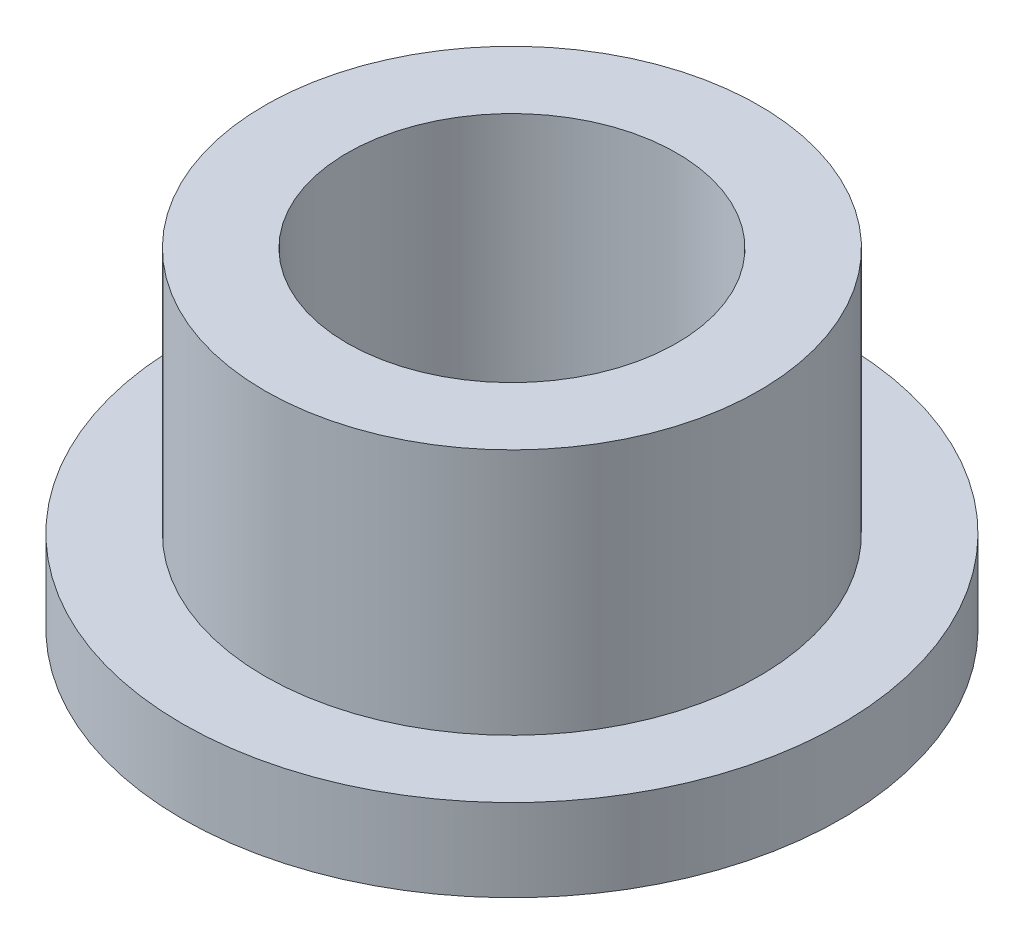
ISO-10303-21;
HEADER;
FILE_DESCRIPTION(('STEP AP214'),'2;1');
FILE_NAME('part.step','',(''),(''),'','','');
FILE_SCHEMA(('AUTOMOTIVE_DESIGN { 1 0 10303 214 1 1 1 1 }'));
ENDSEC;
DATA;
#1=APPLICATION_CONTEXT('core data for automotive mechanical design processes');
#2=APPLICATION_PROTOCOL_DEFINITION('international standard','automotive_design',2000,#1);
#3=PRODUCT_CONTEXT('',#1,'mechanical');
#4=PRODUCT('Part','Part','',(#3));
#5=PRODUCT_RELATED_PRODUCT_CATEGORY('part','',(#4));
#6=PRODUCT_DEFINITION_FORMATION('','',#4);
#7=PRODUCT_DEFINITION_CONTEXT('part definition',#1,'design');
#8=PRODUCT_DEFINITION('design','',#6,#7);
#9=PRODUCT_DEFINITION_SHAPE('','',#8);
#10=(LENGTH_UNIT() NAMED_UNIT(*) SI_UNIT(.MILLI.,.METRE.));
#11=(NAMED_UNIT(*) PLANE_ANGLE_UNIT() SI_UNIT($,.RADIAN.));
#12=(NAMED_UNIT(*) SI_UNIT($,.STERADIAN.) SOLID_ANGLE_UNIT());
#13=UNCERTAINTY_MEASURE_WITH_UNIT(LENGTH_MEASURE(1.E-05),#10,'distance_accuracy_value','');
#14=(GEOMETRIC_REPRESENTATION_CONTEXT(3) GLOBAL_UNCERTAINTY_ASSIGNED_CONTEXT((#13)) GLOBAL_UNIT_ASSIGNED_CONTEXT((#10,
#11,#12)) REPRESENTATION_CONTEXT('',''));
#15=CARTESIAN_POINT('',(0.,0.,0.));
#16=DIRECTION('',(0.,0.,1.));
#17=DIRECTION('',(1.,0.,0.));
#18=AXIS2_PLACEMENT_3D('',#15,#16,#17);
#19=CARTESIAN_POINT('',(0.,6.35,0.));
#20=DIRECTION('',(0.,1.,0.));
#21=DIRECTION('',(0.,0.,1.));
#22=AXIS2_PLACEMENT_3D('',#19,#20,#21);
#23=PLANE('',#22);
#24=CARTESIAN_POINT('',(0.,6.35,0.));
#25=DIRECTION('',(0.,1.,0.));
#26=DIRECTION('',(0.,0.,1.));
#27=AXIS2_PLACEMENT_3D('',#24,#25,#26);
#28=CIRCLE('',#27,4.7625);
#29=CARTESIAN_POINT('',(0.,6.35,4.7625));
#30=VERTEX_POINT('',#29);
#31=EDGE_CURVE('E10',#30,#30,#28,.T.);
#32=ORIENTED_EDGE('',*,*,#31,.T.);
#33=EDGE_LOOP('',(#32));
#34=FACE_BOUND('',#33,.T.);
#35=CARTESIAN_POINT('',(0.,6.35,0.));
#36=DIRECTION('',(0.,1.,0.));
#37=DIRECTION('',(0.,0.,1.));
#38=AXIS2_PLACEMENT_3D('',#35,#36,#37);
#39=CIRCLE('',#38,3.175);
#40=CARTESIAN_POINT('',(0.,6.35,3.175));
#41=VERTEX_POINT('',#40);
#42=EDGE_CURVE('E39',#41,#41,#39,.T.);
#43=ORIENTED_EDGE('',*,*,#42,.F.);
#44=EDGE_LOOP('',(#43));
#45=FACE_BOUND('',#44,.T.);
#46=ADVANCED_FACE('F32',(#34,#45),#23,.T.);
#47=CARTESIAN_POINT('',(0.,0.,0.));
#48=DIRECTION('',(0.,1.,0.));
#49=DIRECTION('',(0.,0.,1.));
#50=AXIS2_PLACEMENT_3D('',#47,#48,#49);
#51=PLANE('',#50);
#52=CARTESIAN_POINT('',(0.,0.,0.));
#53=DIRECTION('',(0.,1.,0.));
#54=DIRECTION('',(0.,0.,1.));
#55=AXIS2_PLACEMENT_3D('',#52,#53,#54);
#56=CIRCLE('',#55,3.175);
#57=CARTESIAN_POINT('',(0.,0.,3.175));
#58=VERTEX_POINT('',#57);
#59=EDGE_CURVE('E43',#58,#58,#56,.T.);
#60=ORIENTED_EDGE('',*,*,#59,.T.);
#61=EDGE_LOOP('',(#60));
#62=FACE_BOUND('',#61,.T.);
#63=CARTESIAN_POINT('',(0.,0.,0.));
#64=DIRECTION('',(0.,1.,0.));
#65=DIRECTION('',(0.,0.,1.));
#66=AXIS2_PLACEMENT_3D('',#63,#64,#65);
#67=CIRCLE('',#66,6.35);
#68=CARTESIAN_POINT('',(0.,0.,6.35));
#69=VERTEX_POINT('',#68);
#70=EDGE_CURVE('E50',#69,#69,#67,.T.);
#71=ORIENTED_EDGE('',*,*,#70,.F.);
#72=EDGE_LOOP('',(#71));
#73=FACE_BOUND('',#72,.T.);
#74=ADVANCED_FACE('F75',(#62,#73),#51,.F.);
#75=CARTESIAN_POINT('',(0.,6.35,0.));
#76=DIRECTION('',(0.,-1.,0.));
#77=DIRECTION('',(0.,0.,-1.));
#78=AXIS2_PLACEMENT_3D('',#75,#76,#77);
#79=CYLINDRICAL_SURFACE('',#78,4.7625);
#80=CARTESIAN_POINT('',(0.,1.5875,0.));
#81=DIRECTION('',(0.,1.,0.));
#82=DIRECTION('',(0.,0.,1.));
#83=AXIS2_PLACEMENT_3D('',#80,#81,#82);
#84=CIRCLE('',#83,4.7625);
#85=CARTESIAN_POINT('',(0.,1.5875,4.7625));
#86=VERTEX_POINT('',#85);
#87=EDGE_CURVE('E53',#86,#86,#84,.T.);
#88=ORIENTED_EDGE('',*,*,#87,.T.);
#89=EDGE_LOOP('',(#88));
#90=FACE_BOUND('',#89,.T.);
#91=ORIENTED_EDGE('',*,*,#31,.F.);
#92=EDGE_LOOP('',(#91));
#93=FACE_BOUND('',#92,.T.);
#94=ADVANCED_FACE('F34',(#90,#93),#79,.T.);
#95=CARTESIAN_POINT('',(0.,6.35,0.));
#96=DIRECTION('',(0.,-1.,0.));
#97=DIRECTION('',(0.,0.,-1.));
#98=AXIS2_PLACEMENT_3D('',#95,#96,#97);
#99=CYLINDRICAL_SURFACE('',#98,3.175);
#100=ORIENTED_EDGE('',*,*,#42,.T.);
#101=EDGE_LOOP('',(#100));
#102=FACE_BOUND('',#101,.T.);
#103=ORIENTED_EDGE('',*,*,#59,.F.);
#104=EDGE_LOOP('',(#103));
#105=FACE_BOUND('',#104,.T.);
#106=ADVANCED_FACE('F64',(#102,#105),#99,.F.);
#107=CARTESIAN_POINT('',(0.,1.5875,0.));
#108=DIRECTION('',(0.,1.,0.));
#109=DIRECTION('',(0.,0.,1.));
#110=AXIS2_PLACEMENT_3D('',#107,#108,#109);
#111=PLANE('',#110);
#112=CARTESIAN_POINT('',(0.,1.5875,0.));
#113=DIRECTION('',(0.,1.,0.));
#114=DIRECTION('',(0.,0.,1.));
#115=AXIS2_PLACEMENT_3D('',#112,#113,#114);
#116=CIRCLE('',#115,6.35);
#117=CARTESIAN_POINT('',(0.,1.5875,6.35));
#118=VERTEX_POINT('',#117);
#119=EDGE_CURVE('E48',#118,#118,#116,.T.);
#120=ORIENTED_EDGE('',*,*,#119,.T.);
#121=EDGE_LOOP('',(#120));
#122=FACE_BOUND('',#121,.T.);
#123=ORIENTED_EDGE('',*,*,#87,.F.);
#124=EDGE_LOOP('',(#123));
#125=FACE_BOUND('',#124,.T.);
#126=ADVANCED_FACE('F61',(#122,#125),#111,.T.);
#127=CARTESIAN_POINT('',(0.,1.5875,0.));
#128=DIRECTION('',(0.,-1.,0.));
#129=DIRECTION('',(0.,0.,-1.));
#130=AXIS2_PLACEMENT_3D('',#127,#128,#129);
#131=CYLINDRICAL_SURFACE('',#130,6.35);
#132=ORIENTED_EDGE('',*,*,#119,.F.);
#133=EDGE_LOOP('',(#132));
#134=FACE_BOUND('',#133,.T.);
#135=ORIENTED_EDGE('',*,*,#70,.T.);
#136=EDGE_LOOP('',(#135));
#137=FACE_BOUND('',#136,.T.);
#138=ADVANCED_FACE('F63',(#134,#137),#131,.T.);
#139=CLOSED_SHELL('',(#46,#74,#94,#106,#126,#138));
#140=MANIFOLD_SOLID_BREP('B2',#139);
#141=ADVANCED_BREP_SHAPE_REPRESENTATION('',(#18,#140),#14);
#142=SHAPE_DEFINITION_REPRESENTATION(#9,#141);
ENDSEC;
END-ISO-10303-21;
